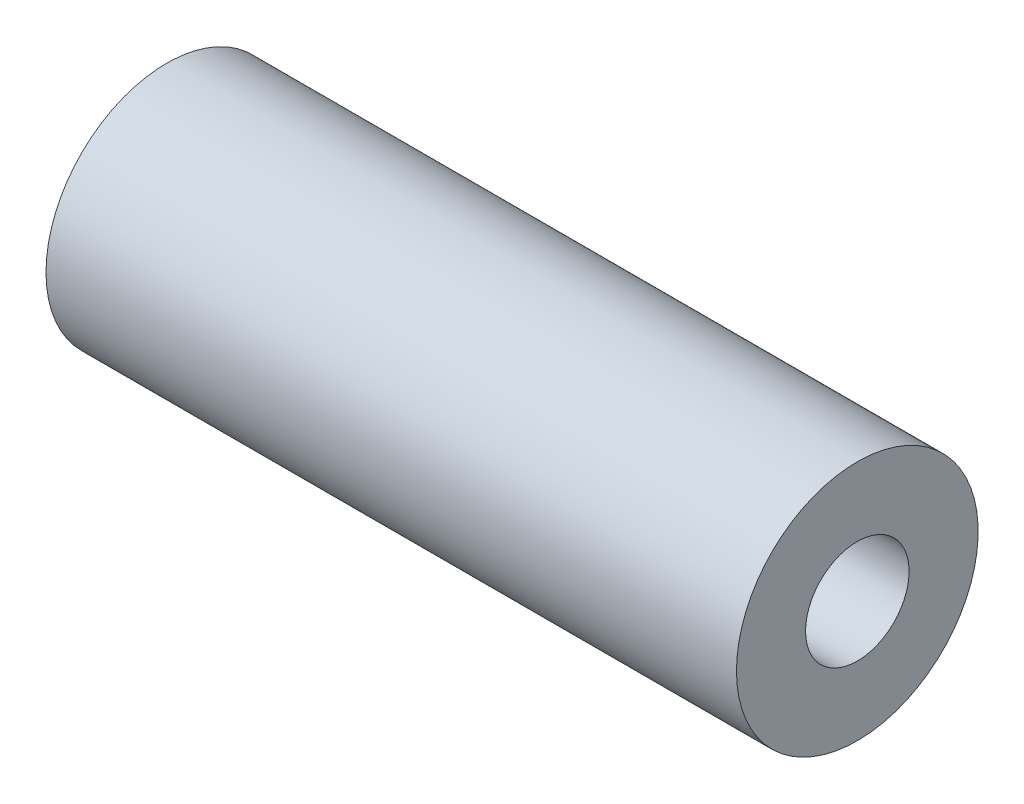
ISO-10303-21;
HEADER;
FILE_DESCRIPTION(('STEP AP214'),'2;1');
FILE_NAME('part.step','',(''),(''),'','','');
FILE_SCHEMA(('AUTOMOTIVE_DESIGN { 1 0 10303 214 1 1 1 1 }'));
ENDSEC;
DATA;
#1=APPLICATION_CONTEXT('core data for automotive mechanical design processes');
#2=APPLICATION_PROTOCOL_DEFINITION('international standard','automotive_design',2000,#1);
#3=PRODUCT_CONTEXT('',#1,'mechanical');
#4=PRODUCT('Part','Part','',(#3));
#5=PRODUCT_RELATED_PRODUCT_CATEGORY('part','',(#4));
#6=PRODUCT_DEFINITION_FORMATION('','',#4);
#7=PRODUCT_DEFINITION_CONTEXT('part definition',#1,'design');
#8=PRODUCT_DEFINITION('design','',#6,#7);
#9=PRODUCT_DEFINITION_SHAPE('','',#8);
#10=(LENGTH_UNIT() NAMED_UNIT(*) SI_UNIT(.MILLI.,.METRE.));
#11=(NAMED_UNIT(*) PLANE_ANGLE_UNIT() SI_UNIT($,.RADIAN.));
#12=(NAMED_UNIT(*) SI_UNIT($,.STERADIAN.) SOLID_ANGLE_UNIT());
#13=UNCERTAINTY_MEASURE_WITH_UNIT(LENGTH_MEASURE(1.E-05),#10,'distance_accuracy_value','');
#14=(GEOMETRIC_REPRESENTATION_CONTEXT(3) GLOBAL_UNCERTAINTY_ASSIGNED_CONTEXT((#13)) GLOBAL_UNIT_ASSIGNED_CONTEXT((#10,
#11,#12)) REPRESENTATION_CONTEXT('',''));
#15=CARTESIAN_POINT('',(0.,0.,0.));
#16=DIRECTION('',(0.,0.,1.));
#17=DIRECTION('',(1.,0.,0.));
#18=AXIS2_PLACEMENT_3D('',#15,#16,#17);
#19=CARTESIAN_POINT('',(-20.,7.,0.));
#20=DIRECTION('',(1.,0.,0.));
#21=DIRECTION('',(0.,0.,-1.));
#22=AXIS2_PLACEMENT_3D('',#19,#20,#21);
#23=PLANE('',#22);
#24=CARTESIAN_POINT('',(-20.,0.,0.));
#25=DIRECTION('',(-1.,0.,0.));
#26=DIRECTION('',(0.,0.,1.));
#27=AXIS2_PLACEMENT_3D('',#24,#25,#26);
#28=CIRCLE('',#27,3.);
#29=CARTESIAN_POINT('',(-20.,0.,3.));
#30=VERTEX_POINT('',#29);
#31=EDGE_CURVE('E10',#30,#30,#28,.T.);
#32=ORIENTED_EDGE('',*,*,#31,.F.);
#33=EDGE_LOOP('',(#32));
#34=FACE_BOUND('',#33,.T.);
#35=CARTESIAN_POINT('',(-20.,0.,0.));
#36=DIRECTION('',(-1.,0.,0.));
#37=DIRECTION('',(0.,0.,1.));
#38=AXIS2_PLACEMENT_3D('',#35,#36,#37);
#39=CIRCLE('',#38,7.);
#40=CARTESIAN_POINT('',(-20.,0.,7.));
#41=VERTEX_POINT('',#40);
#42=EDGE_CURVE('E43',#41,#41,#39,.T.);
#43=ORIENTED_EDGE('',*,*,#42,.T.);
#44=EDGE_LOOP('',(#43));
#45=FACE_BOUND('',#44,.T.);
#46=ADVANCED_FACE('F29',(#34,#45),#23,.F.);
#47=CARTESIAN_POINT('',(-37.0031632185857,0.,0.));
#48=DIRECTION('',(-1.,0.,0.));
#49=DIRECTION('',(0.,0.,1.));
#50=AXIS2_PLACEMENT_3D('',#47,#48,#49);
#51=CYLINDRICAL_SURFACE('',#50,3.);
#52=CARTESIAN_POINT('',(20.,0.,0.));
#53=DIRECTION('',(-1.,0.,0.));
#54=DIRECTION('',(0.,0.,1.));
#55=AXIS2_PLACEMENT_3D('',#52,#53,#54);
#56=CIRCLE('',#55,3.);
#57=CARTESIAN_POINT('',(20.,0.,3.));
#58=VERTEX_POINT('',#57);
#59=EDGE_CURVE('E35',#58,#58,#56,.T.);
#60=ORIENTED_EDGE('',*,*,#59,.F.);
#61=EDGE_LOOP('',(#60));
#62=FACE_BOUND('',#61,.T.);
#63=ORIENTED_EDGE('',*,*,#31,.T.);
#64=EDGE_LOOP('',(#63));
#65=FACE_BOUND('',#64,.T.);
#66=ADVANCED_FACE('F58',(#62,#65),#51,.F.);
#67=CARTESIAN_POINT('',(20.,7.,0.));
#68=DIRECTION('',(-1.,0.,0.));
#69=DIRECTION('',(0.,0.,1.));
#70=AXIS2_PLACEMENT_3D('',#67,#68,#69);
#71=PLANE('',#70);
#72=CARTESIAN_POINT('',(20.,0.,0.));
#73=DIRECTION('',(-1.,0.,0.));
#74=DIRECTION('',(0.,0.,1.));
#75=AXIS2_PLACEMENT_3D('',#72,#73,#74);
#76=CIRCLE('',#75,7.);
#77=CARTESIAN_POINT('',(20.,0.,7.));
#78=VERTEX_POINT('',#77);
#79=EDGE_CURVE('E39',#78,#78,#76,.T.);
#80=ORIENTED_EDGE('',*,*,#79,.F.);
#81=EDGE_LOOP('',(#80));
#82=FACE_BOUND('',#81,.T.);
#83=ORIENTED_EDGE('',*,*,#59,.T.);
#84=EDGE_LOOP('',(#83));
#85=FACE_BOUND('',#84,.T.);
#86=ADVANCED_FACE('F53',(#82,#85),#71,.F.);
#87=CARTESIAN_POINT('',(-37.0031632185857,0.,0.));
#88=DIRECTION('',(-1.,0.,0.));
#89=DIRECTION('',(0.,0.,1.));
#90=AXIS2_PLACEMENT_3D('',#87,#88,#89);
#91=CYLINDRICAL_SURFACE('',#90,7.);
#92=ORIENTED_EDGE('',*,*,#42,.F.);
#93=EDGE_LOOP('',(#92));
#94=FACE_BOUND('',#93,.T.);
#95=ORIENTED_EDGE('',*,*,#79,.T.);
#96=EDGE_LOOP('',(#95));
#97=FACE_BOUND('',#96,.T.);
#98=ADVANCED_FACE('F50',(#94,#97),#91,.T.);
#99=CLOSED_SHELL('',(#46,#66,#86,#98));
#100=MANIFOLD_SOLID_BREP('B2',#99);
#101=ADVANCED_BREP_SHAPE_REPRESENTATION('',(#18,#100),#14);
#102=SHAPE_DEFINITION_REPRESENTATION(#9,#101);
ENDSEC;
END-ISO-10303-21;
